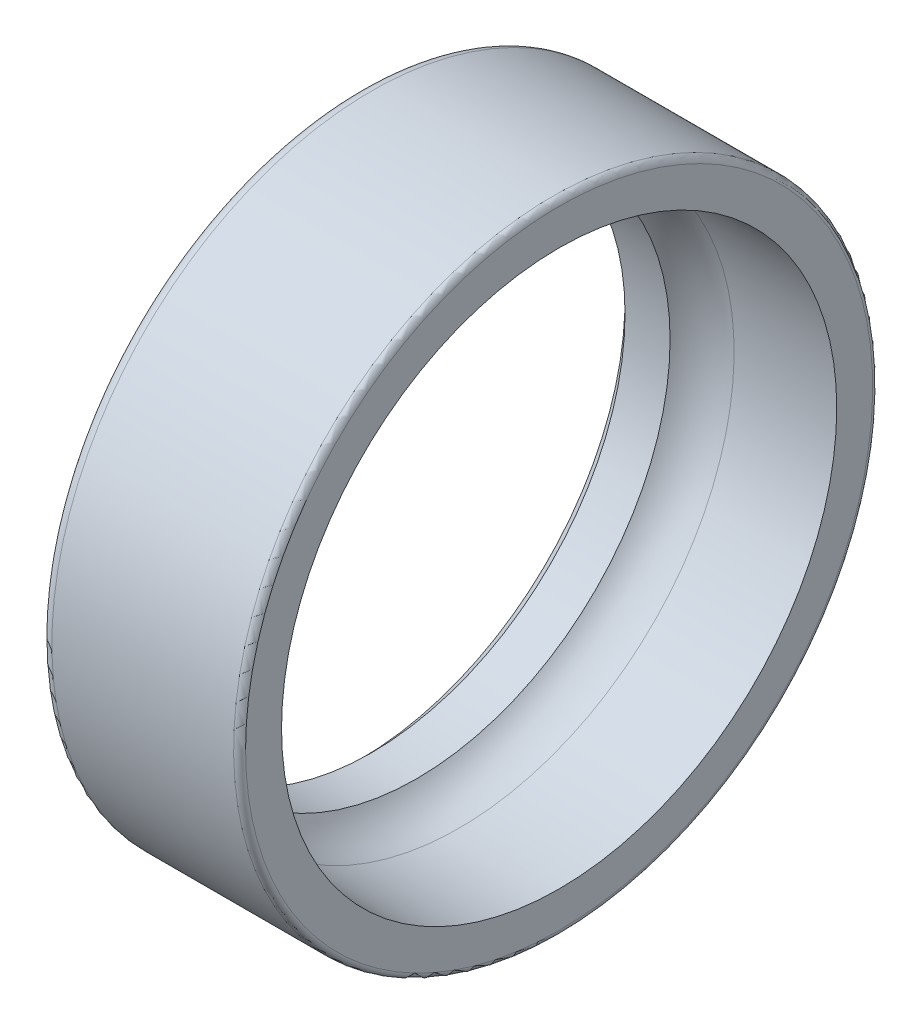
ISO-10303-21;
HEADER;
FILE_DESCRIPTION(('STEP AP214'),'2;1');
FILE_NAME('part.step','',(''),(''),'','','');
FILE_SCHEMA(('AUTOMOTIVE_DESIGN { 1 0 10303 214 1 1 1 1 }'));
ENDSEC;
DATA;
#1=APPLICATION_CONTEXT('core data for automotive mechanical design processes');
#2=APPLICATION_PROTOCOL_DEFINITION('international standard','automotive_design',2000,#1);
#3=PRODUCT_CONTEXT('',#1,'mechanical');
#4=PRODUCT('Part','Part','',(#3));
#5=PRODUCT_RELATED_PRODUCT_CATEGORY('part','',(#4));
#6=PRODUCT_DEFINITION_FORMATION('','',#4);
#7=PRODUCT_DEFINITION_CONTEXT('part definition',#1,'design');
#8=PRODUCT_DEFINITION('design','',#6,#7);
#9=PRODUCT_DEFINITION_SHAPE('','',#8);
#10=(LENGTH_UNIT() NAMED_UNIT(*) SI_UNIT(.MILLI.,.METRE.));
#11=(NAMED_UNIT(*) PLANE_ANGLE_UNIT() SI_UNIT($,.RADIAN.));
#12=(NAMED_UNIT(*) SI_UNIT($,.STERADIAN.) SOLID_ANGLE_UNIT());
#13=UNCERTAINTY_MEASURE_WITH_UNIT(LENGTH_MEASURE(1.E-05),#10,'distance_accuracy_value','');
#14=(GEOMETRIC_REPRESENTATION_CONTEXT(3) GLOBAL_UNCERTAINTY_ASSIGNED_CONTEXT((#13)) GLOBAL_UNIT_ASSIGNED_CONTEXT((#10,
#11,#12)) REPRESENTATION_CONTEXT('',''));
#15=CARTESIAN_POINT('',(0.,0.,0.));
#16=DIRECTION('',(0.,0.,1.));
#17=DIRECTION('',(1.,0.,0.));
#18=AXIS2_PLACEMENT_3D('',#15,#16,#17);
#19=CARTESIAN_POINT('',(0.,14.35,0.));
#20=DIRECTION('',(-1.,0.,0.));
#21=DIRECTION('',(0.,1.,0.));
#22=AXIS2_PLACEMENT_3D('',#19,#20,#21);
#23=PLANE('',#22);
#24=CARTESIAN_POINT('',(0.,0.,0.));
#25=DIRECTION('',(1.,0.,0.));
#26=DIRECTION('',(0.,1.,0.));
#27=AXIS2_PLACEMENT_3D('',#24,#25,#26);
#28=CIRCLE('',#27,13.3);
#29=CARTESIAN_POINT('',(0.,-13.3,0.));
#30=VERTEX_POINT('',#29);
#31=EDGE_CURVE('E86',#30,#30,#28,.T.);
#32=ORIENTED_EDGE('',*,*,#31,.T.);
#33=EDGE_LOOP('',(#32));
#34=FACE_BOUND('',#33,.T.);
#35=CARTESIAN_POINT('',(0.,0.,0.));
#36=DIRECTION('',(1.,0.,0.));
#37=DIRECTION('',(0.,1.,0.));
#38=AXIS2_PLACEMENT_3D('',#35,#36,#37);
#39=CIRCLE('',#38,15.4);
#40=CARTESIAN_POINT('',(0.,0.,15.4));
#41=VERTEX_POINT('',#40);
#42=EDGE_CURVE('E72',#41,#41,#39,.T.);
#43=ORIENTED_EDGE('',*,*,#42,.F.);
#44=EDGE_LOOP('',(#43));
#45=FACE_BOUND('',#44,.T.);
#46=ADVANCED_FACE('F17',(#34,#45),#23,.T.);
#47=CARTESIAN_POINT('',(10.,14.8,0.));
#48=DIRECTION('',(1.,0.,0.));
#49=DIRECTION('',(0.,-1.,0.));
#50=AXIS2_PLACEMENT_3D('',#47,#48,#49);
#51=PLANE('',#50);
#52=CARTESIAN_POINT('',(10.,0.,0.));
#53=DIRECTION('',(1.,0.,0.));
#54=DIRECTION('',(0.,1.,0.));
#55=AXIS2_PLACEMENT_3D('',#52,#53,#54);
#56=CIRCLE('',#55,13.9);
#57=CARTESIAN_POINT('',(10.,-13.9,0.));
#58=VERTEX_POINT('',#57);
#59=EDGE_CURVE('E80',#58,#58,#56,.T.);
#60=ORIENTED_EDGE('',*,*,#59,.F.);
#61=EDGE_LOOP('',(#60));
#62=FACE_BOUND('',#61,.T.);
#63=CARTESIAN_POINT('',(10.,0.,0.));
#64=DIRECTION('',(1.,0.,0.));
#65=DIRECTION('',(0.,1.,0.));
#66=AXIS2_PLACEMENT_3D('',#63,#64,#65);
#67=CIRCLE('',#66,15.7);
#68=CARTESIAN_POINT('',(10.,0.,15.7));
#69=VERTEX_POINT('',#68);
#70=EDGE_CURVE('E27',#69,#69,#67,.T.);
#71=ORIENTED_EDGE('',*,*,#70,.T.);
#72=EDGE_LOOP('',(#71));
#73=FACE_BOUND('',#72,.T.);
#74=ADVANCED_FACE('F114',(#62,#73),#51,.T.);
#75=CARTESIAN_POINT('',(5.15,0.,0.));
#76=DIRECTION('',(1.,0.,0.));
#77=DIRECTION('',(0.,1.,0.));
#78=AXIS2_PLACEMENT_3D('',#75,#76,#77);
#79=CYLINDRICAL_SURFACE('',#78,16.);
#80=CARTESIAN_POINT('',(0.6,0.,0.));
#81=DIRECTION('',(1.,0.,0.));
#82=DIRECTION('',(0.,1.,0.));
#83=AXIS2_PLACEMENT_3D('',#80,#81,#82);
#84=CIRCLE('',#83,16.);
#85=CARTESIAN_POINT('',(0.6,-16.,0.));
#86=VERTEX_POINT('',#85);
#87=EDGE_CURVE('E67',#86,#86,#84,.T.);
#88=ORIENTED_EDGE('',*,*,#87,.T.);
#89=EDGE_LOOP('',(#88));
#90=FACE_BOUND('',#89,.T.);
#91=CARTESIAN_POINT('',(9.7,0.,0.));
#92=DIRECTION('',(1.,0.,0.));
#93=DIRECTION('',(0.,1.,0.));
#94=AXIS2_PLACEMENT_3D('',#91,#92,#93);
#95=CIRCLE('',#94,16.);
#96=CARTESIAN_POINT('',(9.7,-16.,0.));
#97=VERTEX_POINT('',#96);
#98=EDGE_CURVE('E11',#97,#97,#95,.T.);
#99=ORIENTED_EDGE('',*,*,#98,.F.);
#100=EDGE_LOOP('',(#99));
#101=FACE_BOUND('',#100,.T.);
#102=ADVANCED_FACE('F68',(#90,#101),#79,.T.);
#103=CARTESIAN_POINT('',(9.7,0.,0.));
#104=DIRECTION('',(1.,0.,0.));
#105=DIRECTION('',(0.,0.,-1.));
#106=AXIS2_PLACEMENT_3D('',#103,#104,#105);
#107=TOROIDAL_SURFACE('',#106,15.7,0.3);
#108=ORIENTED_EDGE('',*,*,#98,.T.);
#109=EDGE_LOOP('',(#108));
#110=FACE_BOUND('',#109,.T.);
#111=ORIENTED_EDGE('',*,*,#70,.F.);
#112=EDGE_LOOP('',(#111));
#113=FACE_BOUND('',#112,.T.);
#114=ADVANCED_FACE('F109',(#110,#113),#107,.T.);
#115=CARTESIAN_POINT('',(7.4922718588689,0.,0.));
#116=DIRECTION('',(1.,0.,0.));
#117=DIRECTION('',(0.,1.,0.));
#118=AXIS2_PLACEMENT_3D('',#115,#116,#117);
#119=CONICAL_SURFACE('',#118,13.8385836252509,0.0244859476395208);
#120=CARTESIAN_POINT('',(4.9845437177378,0.,0.));
#121=DIRECTION('',(1.,0.,0.));
#122=DIRECTION('',(0.,1.,0.));
#123=AXIS2_PLACEMENT_3D('',#120,#121,#122);
#124=CIRCLE('',#123,13.7771672505017);
#125=CARTESIAN_POINT('',(4.9845437177378,13.7771672505017,0.));
#126=VERTEX_POINT('',#125);
#127=EDGE_CURVE('E82',#126,#126,#124,.T.);
#128=ORIENTED_EDGE('',*,*,#127,.F.);
#129=EDGE_LOOP('',(#128));
#130=FACE_BOUND('',#129,.T.);
#131=ORIENTED_EDGE('',*,*,#59,.T.);
#132=EDGE_LOOP('',(#131));
#133=FACE_BOUND('',#132,.T.);
#134=ADVANCED_FACE('F98',(#130,#133),#119,.F.);
#135=CARTESIAN_POINT('',(5.05255888325765,0.,0.));
#136=DIRECTION('',(1.,0.,0.));
#137=DIRECTION('',(0.,0.,-1.));
#138=AXIS2_PLACEMENT_3D('',#135,#136,#137);
#139=TOROIDAL_SURFACE('',#138,11.,2.778);
#140=ORIENTED_EDGE('',*,*,#127,.T.);
#141=EDGE_LOOP('',(#140));
#142=FACE_BOUND('',#141,.T.);
#143=CARTESIAN_POINT('',(2.85545078395985,0.,0.));
#144=DIRECTION('',(1.,0.,0.));
#145=DIRECTION('',(0.,1.,0.));
#146=AXIS2_PLACEMENT_3D('',#143,#144,#145);
#147=CIRCLE('',#146,12.7);
#148=CARTESIAN_POINT('',(2.85545078395985,0.,12.7));
#149=VERTEX_POINT('',#148);
#150=EDGE_CURVE('E85',#149,#149,#147,.T.);
#151=ORIENTED_EDGE('',*,*,#150,.F.);
#152=EDGE_LOOP('',(#151));
#153=FACE_BOUND('',#152,.T.);
#154=ADVANCED_FACE('F96',(#142,#153),#139,.F.);
#155=CARTESIAN_POINT('',(1.72772539197992,0.,0.));
#156=DIRECTION('',(1.,0.,0.));
#157=DIRECTION('',(0.,1.,0.));
#158=AXIS2_PLACEMENT_3D('',#155,#156,#157);
#159=CYLINDRICAL_SURFACE('',#158,12.7);
#160=CARTESIAN_POINT('',(0.6,0.,0.));
#161=DIRECTION('',(1.,0.,0.));
#162=DIRECTION('',(0.,1.,0.));
#163=AXIS2_PLACEMENT_3D('',#160,#161,#162);
#164=CIRCLE('',#163,12.7);
#165=CARTESIAN_POINT('',(0.6,-12.7,0.));
#166=VERTEX_POINT('',#165);
#167=EDGE_CURVE('E20',#166,#166,#164,.T.);
#168=ORIENTED_EDGE('',*,*,#167,.F.);
#169=EDGE_LOOP('',(#168));
#170=FACE_BOUND('',#169,.T.);
#171=ORIENTED_EDGE('',*,*,#150,.T.);
#172=EDGE_LOOP('',(#171));
#173=FACE_BOUND('',#172,.T.);
#174=ADVANCED_FACE('F94',(#170,#173),#159,.F.);
#175=CARTESIAN_POINT('',(0.3,0.,0.));
#176=DIRECTION('',(-1.,0.,0.));
#177=DIRECTION('',(0.,1.,0.));
#178=AXIS2_PLACEMENT_3D('',#175,#176,#177);
#179=CONICAL_SURFACE('',#178,13.,0.785398163397446);
#180=ORIENTED_EDGE('',*,*,#31,.F.);
#181=EDGE_LOOP('',(#180));
#182=FACE_BOUND('',#181,.T.);
#183=ORIENTED_EDGE('',*,*,#167,.T.);
#184=EDGE_LOOP('',(#183));
#185=FACE_BOUND('',#184,.T.);
#186=ADVANCED_FACE('F106',(#182,#185),#179,.F.);
#187=CARTESIAN_POINT('',(0.6,0.,0.));
#188=DIRECTION('',(1.,0.,0.));
#189=DIRECTION('',(0.,0.,-1.));
#190=AXIS2_PLACEMENT_3D('',#187,#188,#189);
#191=TOROIDAL_SURFACE('',#190,15.4,0.6);
#192=ORIENTED_EDGE('',*,*,#42,.T.);
#193=EDGE_LOOP('',(#192));
#194=FACE_BOUND('',#193,.T.);
#195=ORIENTED_EDGE('',*,*,#87,.F.);
#196=EDGE_LOOP('',(#195));
#197=FACE_BOUND('',#196,.T.);
#198=ADVANCED_FACE('F125',(#194,#197),#191,.T.);
#199=CLOSED_SHELL('',(#46,#74,#102,#114,#134,#154,#174,#186,#198));
#200=MANIFOLD_SOLID_BREP('B1',#199);
#201=ADVANCED_BREP_SHAPE_REPRESENTATION('',(#18,#200),#14);
#202=SHAPE_DEFINITION_REPRESENTATION(#9,#201);
ENDSEC;
END-ISO-10303-21;
